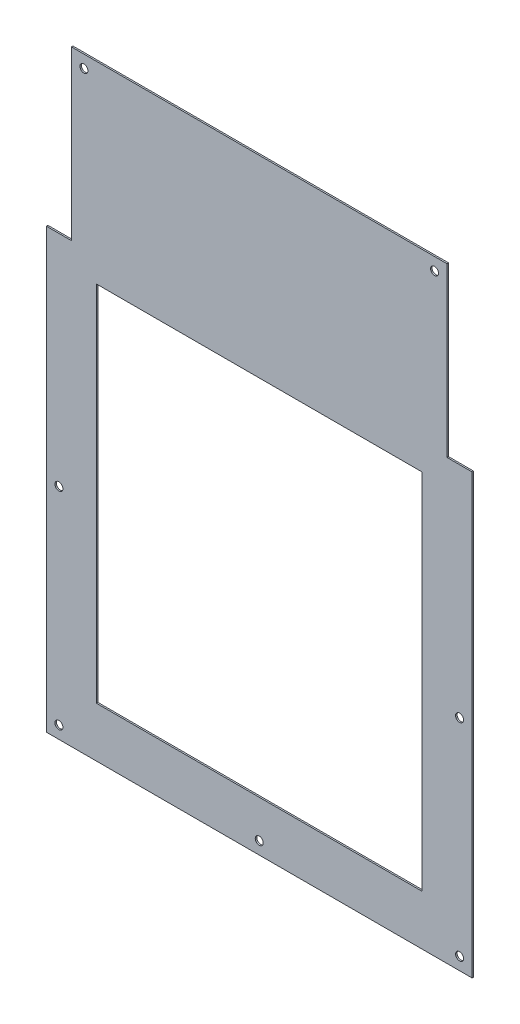
ISO-10303-21;
HEADER;
FILE_DESCRIPTION(('STEP AP214'),'2;1');
FILE_NAME('part.step','',(''),(''),'','','');
FILE_SCHEMA(('AUTOMOTIVE_DESIGN { 1 0 10303 214 1 1 1 1 }'));
ENDSEC;
DATA;
#1=APPLICATION_CONTEXT('core data for automotive mechanical design processes');
#2=APPLICATION_PROTOCOL_DEFINITION('international standard','automotive_design',2000,#1);
#3=PRODUCT_CONTEXT('',#1,'mechanical');
#4=PRODUCT('Part','Part','',(#3));
#5=PRODUCT_RELATED_PRODUCT_CATEGORY('part','',(#4));
#6=PRODUCT_DEFINITION_FORMATION('','',#4);
#7=PRODUCT_DEFINITION_CONTEXT('part definition',#1,'design');
#8=PRODUCT_DEFINITION('design','',#6,#7);
#9=PRODUCT_DEFINITION_SHAPE('','',#8);
#10=(LENGTH_UNIT() NAMED_UNIT(*) SI_UNIT(.MILLI.,.METRE.));
#11=(NAMED_UNIT(*) PLANE_ANGLE_UNIT() SI_UNIT($,.RADIAN.));
#12=(NAMED_UNIT(*) SI_UNIT($,.STERADIAN.) SOLID_ANGLE_UNIT());
#13=UNCERTAINTY_MEASURE_WITH_UNIT(LENGTH_MEASURE(1.E-05),#10,'distance_accuracy_value','');
#14=(GEOMETRIC_REPRESENTATION_CONTEXT(3) GLOBAL_UNCERTAINTY_ASSIGNED_CONTEXT((#13)) GLOBAL_UNIT_ASSIGNED_CONTEXT((#10,
#11,#12)) REPRESENTATION_CONTEXT('',''));
#15=CARTESIAN_POINT('',(0.,0.,0.));
#16=DIRECTION('',(0.,0.,1.));
#17=DIRECTION('',(1.,0.,0.));
#18=AXIS2_PLACEMENT_3D('',#15,#16,#17);
#19=CARTESIAN_POINT('',(0.,0.,0.6));
#20=DIRECTION('',(0.,0.,1.));
#21=DIRECTION('',(1.,0.,0.));
#22=AXIS2_PLACEMENT_3D('',#19,#20,#21);
#23=PLANE('',#22);
#24=CARTESIAN_POINT('',(85.,1079.,0.6));
#25=DIRECTION('',(0.,0.,1.));
#26=DIRECTION('',(1.,0.,0.));
#27=AXIS2_PLACEMENT_3D('',#24,#25,#26);
#28=CIRCLE('',#27,1.60000000000004);
#29=CARTESIAN_POINT('',(86.6000000000001,1079.,0.6));
#30=VERTEX_POINT('',#29);
#31=EDGE_CURVE('E328',#30,#30,#28,.T.);
#32=ORIENTED_EDGE('',*,*,#31,.F.);
#33=EDGE_LOOP('',(#32));
#34=FACE_BOUND('',#33,.T.);
#35=CARTESIAN_POINT('',(155.,847.,0.6));
#36=DIRECTION('',(0.,0.,1.));
#37=DIRECTION('',(1.,0.,0.));
#38=AXIS2_PLACEMENT_3D('',#35,#36,#37);
#39=CIRCLE('',#38,1.60000000000003);
#40=CARTESIAN_POINT('',(156.6,847.,0.6));
#41=VERTEX_POINT('',#40);
#42=EDGE_CURVE('E333',#41,#41,#39,.T.);
#43=ORIENTED_EDGE('',*,*,#42,.F.);
#44=EDGE_LOOP('',(#43));
#45=FACE_BOUND('',#44,.T.);
#46=CARTESIAN_POINT('',(225.,1079.,0.6));
#47=DIRECTION('',(0.,0.,1.));
#48=DIRECTION('',(-1.,0.,0.));
#49=AXIS2_PLACEMENT_3D('',#46,#47,#48);
#50=CIRCLE('',#49,1.60000000000003);
#51=CARTESIAN_POINT('',(223.4,1079.,0.6));
#52=VERTEX_POINT('',#51);
#53=EDGE_CURVE('E341',#52,#52,#50,.T.);
#54=ORIENTED_EDGE('',*,*,#53,.F.);
#55=EDGE_LOOP('',(#54));
#56=FACE_BOUND('',#55,.T.);
#57=CARTESIAN_POINT('',(74.9999999999998,929.5,0.6));
#58=DIRECTION('',(0.,0.,1.));
#59=DIRECTION('',(1.,0.,0.));
#60=AXIS2_PLACEMENT_3D('',#57,#58,#59);
#61=CIRCLE('',#60,1.60000000000003);
#62=CARTESIAN_POINT('',(76.5999999999998,929.5,0.6));
#63=VERTEX_POINT('',#62);
#64=EDGE_CURVE('E347',#63,#63,#61,.T.);
#65=ORIENTED_EDGE('',*,*,#64,.F.);
#66=EDGE_LOOP('',(#65));
#67=FACE_BOUND('',#66,.T.);
#68=CARTESIAN_POINT('',(235.,929.5,0.6));
#69=DIRECTION('',(0.,0.,1.));
#70=DIRECTION('',(-1.,0.,0.));
#71=AXIS2_PLACEMENT_3D('',#68,#69,#70);
#72=CIRCLE('',#71,1.60000000000003);
#73=CARTESIAN_POINT('',(233.4,929.5,0.6));
#74=VERTEX_POINT('',#73);
#75=EDGE_CURVE('E353',#74,#74,#72,.T.);
#76=ORIENTED_EDGE('',*,*,#75,.F.);
#77=EDGE_LOOP('',(#76));
#78=FACE_BOUND('',#77,.T.);
#79=CARTESIAN_POINT('',(74.9999999999998,847.,0.6));
#80=DIRECTION('',(0.,0.,1.));
#81=DIRECTION('',(1.,0.,0.));
#82=AXIS2_PLACEMENT_3D('',#79,#80,#81);
#83=CIRCLE('',#82,1.60000000000003);
#84=CARTESIAN_POINT('',(76.5999999999998,847.,0.6));
#85=VERTEX_POINT('',#84);
#86=EDGE_CURVE('E359',#85,#85,#83,.T.);
#87=ORIENTED_EDGE('',*,*,#86,.F.);
#88=EDGE_LOOP('',(#87));
#89=FACE_BOUND('',#88,.T.);
#90=CARTESIAN_POINT('',(235.,847.,0.6));
#91=DIRECTION('',(0.,0.,1.));
#92=DIRECTION('',(-1.,0.,0.));
#93=AXIS2_PLACEMENT_3D('',#90,#91,#92);
#94=CIRCLE('',#93,1.60000000000003);
#95=CARTESIAN_POINT('',(233.4,847.,0.6));
#96=VERTEX_POINT('',#95);
#97=EDGE_CURVE('E364',#96,#96,#94,.T.);
#98=ORIENTED_EDGE('',*,*,#97,.F.);
#99=EDGE_LOOP('',(#98));
#100=FACE_BOUND('',#99,.T.);
#101=DIRECTION('',(-1.,0.,0.));
#102=VECTOR('',#101,1.);
#103=CARTESIAN_POINT('',(230.,1084.,0.6));
#104=LINE('',#103,#102);
#105=CARTESIAN_POINT('',(230.,1084.,0.6));
#106=VERTEX_POINT('',#105);
#107=CARTESIAN_POINT('',(80.,1084.,0.6));
#108=VERTEX_POINT('',#107);
#109=EDGE_CURVE('E165',#106,#108,#104,.T.);
#110=ORIENTED_EDGE('',*,*,#109,.T.);
#111=DIRECTION('',(0.,-1.,0.));
#112=VECTOR('',#111,1.);
#113=CARTESIAN_POINT('',(80.,1084.,0.6));
#114=LINE('',#113,#112);
#115=CARTESIAN_POINT('',(80.,1017.,0.6));
#116=VERTEX_POINT('',#115);
#117=EDGE_CURVE('E168',#108,#116,#114,.T.);
#118=ORIENTED_EDGE('',*,*,#117,.T.);
#119=DIRECTION('',(-1.,0.,0.));
#120=VECTOR('',#119,1.);
#121=CARTESIAN_POINT('',(80.,1017.,0.6));
#122=LINE('',#121,#120);
#123=CARTESIAN_POINT('',(69.9999999999998,1017.,0.6));
#124=VERTEX_POINT('',#123);
#125=EDGE_CURVE('E171',#116,#124,#122,.T.);
#126=ORIENTED_EDGE('',*,*,#125,.T.);
#127=DIRECTION('',(0.,-1.,0.));
#128=VECTOR('',#127,1.);
#129=CARTESIAN_POINT('',(69.9999999999998,1017.,0.6));
#130=LINE('',#129,#128);
#131=CARTESIAN_POINT('',(69.9999999999998,842.,0.6));
#132=VERTEX_POINT('',#131);
#133=EDGE_CURVE('E173',#124,#132,#130,.T.);
#134=ORIENTED_EDGE('',*,*,#133,.T.);
#135=DIRECTION('',(1.,0.,0.));
#136=VECTOR('',#135,1.);
#137=CARTESIAN_POINT('',(69.9999999999998,842.,0.6));
#138=LINE('',#137,#136);
#139=CARTESIAN_POINT('',(240.,842.,0.6));
#140=VERTEX_POINT('',#139);
#141=EDGE_CURVE('E175',#132,#140,#138,.T.);
#142=ORIENTED_EDGE('',*,*,#141,.T.);
#143=DIRECTION('',(0.,1.,0.));
#144=VECTOR('',#143,1.);
#145=CARTESIAN_POINT('',(240.,842.,0.6));
#146=LINE('',#145,#144);
#147=CARTESIAN_POINT('',(240.,1017.,0.6));
#148=VERTEX_POINT('',#147);
#149=EDGE_CURVE('E177',#140,#148,#146,.T.);
#150=ORIENTED_EDGE('',*,*,#149,.T.);
#151=DIRECTION('',(-1.,0.,0.));
#152=VECTOR('',#151,1.);
#153=CARTESIAN_POINT('',(240.,1017.,0.6));
#154=LINE('',#153,#152);
#155=CARTESIAN_POINT('',(230.,1017.,0.6));
#156=VERTEX_POINT('',#155);
#157=EDGE_CURVE('E179',#148,#156,#154,.T.);
#158=ORIENTED_EDGE('',*,*,#157,.T.);
#159=DIRECTION('',(0.,1.,0.));
#160=VECTOR('',#159,1.);
#161=CARTESIAN_POINT('',(230.,1017.,0.6));
#162=LINE('',#161,#160);
#163=EDGE_CURVE('E181',#156,#106,#162,.T.);
#164=ORIENTED_EDGE('',*,*,#163,.T.);
#165=EDGE_LOOP('',(#110,#118,#126,#134,#142,#150,#158,#164));
#166=FACE_BOUND('',#165,.T.);
#167=DIRECTION('',(1.,0.,0.));
#168=VECTOR('',#167,1.);
#169=CARTESIAN_POINT('',(89.9999999999998,862.,0.6));
#170=LINE('',#169,#168);
#171=CARTESIAN_POINT('',(89.9999999999998,862.,0.6));
#172=VERTEX_POINT('',#171);
#173=CARTESIAN_POINT('',(220.,862.,0.6));
#174=VERTEX_POINT('',#173);
#175=EDGE_CURVE('E132',#172,#174,#170,.T.);
#176=ORIENTED_EDGE('',*,*,#175,.F.);
#177=DIRECTION('',(0.,-1.,0.));
#178=VECTOR('',#177,1.);
#179=CARTESIAN_POINT('',(89.9999999999998,996.999999999999,0.6));
#180=LINE('',#179,#178);
#181=CARTESIAN_POINT('',(90.,1007.,0.6));
#182=VERTEX_POINT('',#181);
#183=EDGE_CURVE('E124',#182,#172,#180,.T.);
#184=ORIENTED_EDGE('',*,*,#183,.F.);
#185=DIRECTION('',(-1.,0.,0.));
#186=VECTOR('',#185,1.);
#187=CARTESIAN_POINT('',(90.,1007.,0.6));
#188=LINE('',#187,#186);
#189=CARTESIAN_POINT('',(220.,1007.,0.6));
#190=VERTEX_POINT('',#189);
#191=EDGE_CURVE('E148',#190,#182,#188,.T.);
#192=ORIENTED_EDGE('',*,*,#191,.F.);
#193=DIRECTION('',(0.,1.,0.));
#194=VECTOR('',#193,1.);
#195=CARTESIAN_POINT('',(220.,862.,0.6));
#196=LINE('',#195,#194);
#197=EDGE_CURVE('E146',#174,#190,#196,.T.);
#198=ORIENTED_EDGE('',*,*,#197,.F.);
#199=EDGE_LOOP('',(#176,#184,#192,#198));
#200=FACE_BOUND('',#199,.T.);
#201=ADVANCED_FACE('F37',(#34,#45,#56,#67,#78,#89,#100,#166,#200),#23,.T.);
#202=CARTESIAN_POINT('',(0.,0.,0.));
#203=DIRECTION('',(0.,0.,1.));
#204=DIRECTION('',(1.,0.,0.));
#205=AXIS2_PLACEMENT_3D('',#202,#203,#204);
#206=PLANE('',#205);
#207=CARTESIAN_POINT('',(85.,1079.,0.));
#208=DIRECTION('',(0.,0.,1.));
#209=DIRECTION('',(1.,0.,0.));
#210=AXIS2_PLACEMENT_3D('',#207,#208,#209);
#211=CIRCLE('',#210,1.60000000000004);
#212=CARTESIAN_POINT('',(86.6000000000001,1079.,0.));
#213=VERTEX_POINT('',#212);
#214=EDGE_CURVE('E155',#213,#213,#211,.T.);
#215=ORIENTED_EDGE('',*,*,#214,.T.);
#216=EDGE_LOOP('',(#215));
#217=FACE_BOUND('',#216,.T.);
#218=CARTESIAN_POINT('',(155.,847.,0.));
#219=DIRECTION('',(0.,0.,1.));
#220=DIRECTION('',(1.,0.,0.));
#221=AXIS2_PLACEMENT_3D('',#218,#219,#220);
#222=CIRCLE('',#221,1.60000000000003);
#223=CARTESIAN_POINT('',(156.6,847.,0.));
#224=VERTEX_POINT('',#223);
#225=EDGE_CURVE('E329',#224,#224,#222,.T.);
#226=ORIENTED_EDGE('',*,*,#225,.T.);
#227=EDGE_LOOP('',(#226));
#228=FACE_BOUND('',#227,.T.);
#229=CARTESIAN_POINT('',(225.,1079.,0.));
#230=DIRECTION('',(0.,0.,1.));
#231=DIRECTION('',(-1.,0.,0.));
#232=AXIS2_PLACEMENT_3D('',#229,#230,#231);
#233=CIRCLE('',#232,1.60000000000003);
#234=CARTESIAN_POINT('',(223.4,1079.,0.));
#235=VERTEX_POINT('',#234);
#236=EDGE_CURVE('E338',#235,#235,#233,.T.);
#237=ORIENTED_EDGE('',*,*,#236,.T.);
#238=EDGE_LOOP('',(#237));
#239=FACE_BOUND('',#238,.T.);
#240=CARTESIAN_POINT('',(74.9999999999998,929.5,0.));
#241=DIRECTION('',(0.,0.,1.));
#242=DIRECTION('',(1.,0.,0.));
#243=AXIS2_PLACEMENT_3D('',#240,#241,#242);
#244=CIRCLE('',#243,1.60000000000003);
#245=CARTESIAN_POINT('',(76.5999999999998,929.5,0.));
#246=VERTEX_POINT('',#245);
#247=EDGE_CURVE('E344',#246,#246,#244,.T.);
#248=ORIENTED_EDGE('',*,*,#247,.T.);
#249=EDGE_LOOP('',(#248));
#250=FACE_BOUND('',#249,.T.);
#251=CARTESIAN_POINT('',(235.,929.5,0.));
#252=DIRECTION('',(0.,0.,1.));
#253=DIRECTION('',(-1.,0.,0.));
#254=AXIS2_PLACEMENT_3D('',#251,#252,#253);
#255=CIRCLE('',#254,1.60000000000003);
#256=CARTESIAN_POINT('',(233.4,929.5,0.));
#257=VERTEX_POINT('',#256);
#258=EDGE_CURVE('E350',#257,#257,#255,.T.);
#259=ORIENTED_EDGE('',*,*,#258,.T.);
#260=EDGE_LOOP('',(#259));
#261=FACE_BOUND('',#260,.T.);
#262=CARTESIAN_POINT('',(74.9999999999998,847.,0.));
#263=DIRECTION('',(0.,0.,1.));
#264=DIRECTION('',(1.,0.,0.));
#265=AXIS2_PLACEMENT_3D('',#262,#263,#264);
#266=CIRCLE('',#265,1.60000000000003);
#267=CARTESIAN_POINT('',(76.5999999999998,847.,0.));
#268=VERTEX_POINT('',#267);
#269=EDGE_CURVE('E356',#268,#268,#266,.T.);
#270=ORIENTED_EDGE('',*,*,#269,.T.);
#271=EDGE_LOOP('',(#270));
#272=FACE_BOUND('',#271,.T.);
#273=CARTESIAN_POINT('',(235.,847.,0.));
#274=DIRECTION('',(0.,0.,1.));
#275=DIRECTION('',(-1.,0.,0.));
#276=AXIS2_PLACEMENT_3D('',#273,#274,#275);
#277=CIRCLE('',#276,1.60000000000003);
#278=CARTESIAN_POINT('',(233.4,847.,0.));
#279=VERTEX_POINT('',#278);
#280=EDGE_CURVE('E362',#279,#279,#277,.T.);
#281=ORIENTED_EDGE('',*,*,#280,.T.);
#282=EDGE_LOOP('',(#281));
#283=FACE_BOUND('',#282,.T.);
#284=DIRECTION('',(-1.,0.,0.));
#285=VECTOR('',#284,1.);
#286=CARTESIAN_POINT('',(230.,1084.,0.));
#287=LINE('',#286,#285);
#288=CARTESIAN_POINT('',(230.,1084.,0.));
#289=VERTEX_POINT('',#288);
#290=CARTESIAN_POINT('',(80.,1084.,0.));
#291=VERTEX_POINT('',#290);
#292=EDGE_CURVE('E142',#289,#291,#287,.T.);
#293=ORIENTED_EDGE('',*,*,#292,.F.);
#294=DIRECTION('',(0.,1.,0.));
#295=VECTOR('',#294,1.);
#296=CARTESIAN_POINT('',(230.,1017.,0.));
#297=LINE('',#296,#295);
#298=CARTESIAN_POINT('',(230.,1017.,0.));
#299=VERTEX_POINT('',#298);
#300=EDGE_CURVE('E169',#299,#289,#297,.T.);
#301=ORIENTED_EDGE('',*,*,#300,.F.);
#302=DIRECTION('',(-1.,0.,0.));
#303=VECTOR('',#302,1.);
#304=CARTESIAN_POINT('',(240.,1017.,0.));
#305=LINE('',#304,#303);
#306=CARTESIAN_POINT('',(240.,1017.,0.));
#307=VERTEX_POINT('',#306);
#308=EDGE_CURVE('E196',#307,#299,#305,.T.);
#309=ORIENTED_EDGE('',*,*,#308,.F.);
#310=DIRECTION('',(0.,1.,0.));
#311=VECTOR('',#310,1.);
#312=CARTESIAN_POINT('',(240.,842.,0.));
#313=LINE('',#312,#311);
#314=CARTESIAN_POINT('',(240.,842.,0.));
#315=VERTEX_POINT('',#314);
#316=EDGE_CURVE('E194',#315,#307,#313,.T.);
#317=ORIENTED_EDGE('',*,*,#316,.F.);
#318=DIRECTION('',(1.,0.,0.));
#319=VECTOR('',#318,1.);
#320=CARTESIAN_POINT('',(69.9999999999998,842.,0.));
#321=LINE('',#320,#319);
#322=CARTESIAN_POINT('',(69.9999999999998,842.,0.));
#323=VERTEX_POINT('',#322);
#324=EDGE_CURVE('E192',#323,#315,#321,.T.);
#325=ORIENTED_EDGE('',*,*,#324,.F.);
#326=DIRECTION('',(0.,-1.,0.));
#327=VECTOR('',#326,1.);
#328=CARTESIAN_POINT('',(69.9999999999998,1017.,0.));
#329=LINE('',#328,#327);
#330=CARTESIAN_POINT('',(69.9999999999998,1017.,0.));
#331=VERTEX_POINT('',#330);
#332=EDGE_CURVE('E190',#331,#323,#329,.T.);
#333=ORIENTED_EDGE('',*,*,#332,.F.);
#334=DIRECTION('',(-1.,0.,0.));
#335=VECTOR('',#334,1.);
#336=CARTESIAN_POINT('',(80.,1017.,0.));
#337=LINE('',#336,#335);
#338=CARTESIAN_POINT('',(80.,1017.,0.));
#339=VERTEX_POINT('',#338);
#340=EDGE_CURVE('E188',#339,#331,#337,.T.);
#341=ORIENTED_EDGE('',*,*,#340,.F.);
#342=DIRECTION('',(0.,-1.,0.));
#343=VECTOR('',#342,1.);
#344=CARTESIAN_POINT('',(80.,1084.,0.));
#345=LINE('',#344,#343);
#346=EDGE_CURVE('E186',#291,#339,#345,.T.);
#347=ORIENTED_EDGE('',*,*,#346,.F.);
#348=EDGE_LOOP('',(#293,#301,#309,#317,#325,#333,#341,#347));
#349=FACE_BOUND('',#348,.T.);
#350=DIRECTION('',(0.,-1.,0.));
#351=VECTOR('',#350,1.);
#352=CARTESIAN_POINT('',(89.9999999999998,996.999999999999,0.));
#353=LINE('',#352,#351);
#354=CARTESIAN_POINT('',(90.,1007.,0.));
#355=VERTEX_POINT('',#354);
#356=CARTESIAN_POINT('',(89.9999999999998,862.,0.));
#357=VERTEX_POINT('',#356);
#358=EDGE_CURVE('E153',#355,#357,#353,.T.);
#359=ORIENTED_EDGE('',*,*,#358,.T.);
#360=DIRECTION('',(1.,0.,0.));
#361=VECTOR('',#360,1.);
#362=CARTESIAN_POINT('',(89.9999999999998,862.,0.));
#363=LINE('',#362,#361);
#364=CARTESIAN_POINT('',(220.,862.,0.));
#365=VERTEX_POINT('',#364);
#366=EDGE_CURVE('E140',#357,#365,#363,.T.);
#367=ORIENTED_EDGE('',*,*,#366,.T.);
#368=DIRECTION('',(0.,1.,0.));
#369=VECTOR('',#368,1.);
#370=CARTESIAN_POINT('',(220.,997.,0.));
#371=LINE('',#370,#369);
#372=CARTESIAN_POINT('',(220.,1007.,0.));
#373=VERTEX_POINT('',#372);
#374=EDGE_CURVE('E157',#365,#373,#371,.T.);
#375=ORIENTED_EDGE('',*,*,#374,.T.);
#376=DIRECTION('',(-1.,0.,0.));
#377=VECTOR('',#376,1.);
#378=CARTESIAN_POINT('',(90.,1007.,0.));
#379=LINE('',#378,#377);
#380=EDGE_CURVE('E133',#373,#355,#379,.T.);
#381=ORIENTED_EDGE('',*,*,#380,.T.);
#382=EDGE_LOOP('',(#359,#367,#375,#381));
#383=FACE_BOUND('',#382,.T.);
#384=ADVANCED_FACE('F226',(#217,#228,#239,#250,#261,#272,#283,#349,#383),#206,.F.);
#385=CARTESIAN_POINT('',(230.,1084.,0.6));
#386=DIRECTION('',(0.,-1.,0.));
#387=DIRECTION('',(0.,0.,-1.));
#388=AXIS2_PLACEMENT_3D('',#385,#386,#387);
#389=PLANE('',#388);
#390=ORIENTED_EDGE('',*,*,#292,.T.);
#391=DIRECTION('',(0.,0.,-1.));
#392=VECTOR('',#391,1.);
#393=CARTESIAN_POINT('',(80.,1084.,0.6));
#394=LINE('',#393,#392);
#395=EDGE_CURVE('E11',#108,#291,#394,.T.);
#396=ORIENTED_EDGE('',*,*,#395,.F.);
#397=ORIENTED_EDGE('',*,*,#109,.F.);
#398=DIRECTION('',(0.,0.,-1.));
#399=VECTOR('',#398,1.);
#400=CARTESIAN_POINT('',(230.,1084.,0.6));
#401=LINE('',#400,#399);
#402=EDGE_CURVE('E183',#106,#289,#401,.T.);
#403=ORIENTED_EDGE('',*,*,#402,.T.);
#404=EDGE_LOOP('',(#390,#396,#397,#403));
#405=FACE_BOUND('',#404,.T.);
#406=ADVANCED_FACE('F39',(#405),#389,.F.);
#407=CARTESIAN_POINT('',(80.,1084.,0.6));
#408=DIRECTION('',(1.,0.,0.));
#409=DIRECTION('',(0.,0.,-1.));
#410=AXIS2_PLACEMENT_3D('',#407,#408,#409);
#411=PLANE('',#410);
#412=ORIENTED_EDGE('',*,*,#346,.T.);
#413=DIRECTION('',(0.,0.,-1.));
#414=VECTOR('',#413,1.);
#415=CARTESIAN_POINT('',(80.,1017.,0.6));
#416=LINE('',#415,#414);
#417=EDGE_CURVE('E45',#116,#339,#416,.T.);
#418=ORIENTED_EDGE('',*,*,#417,.F.);
#419=ORIENTED_EDGE('',*,*,#117,.F.);
#420=ORIENTED_EDGE('',*,*,#395,.T.);
#421=EDGE_LOOP('',(#412,#418,#419,#420));
#422=FACE_BOUND('',#421,.T.);
#423=ADVANCED_FACE('F243',(#422),#411,.F.);
#424=CARTESIAN_POINT('',(80.,1017.,0.6));
#425=DIRECTION('',(0.,-1.,0.));
#426=DIRECTION('',(0.,0.,-1.));
#427=AXIS2_PLACEMENT_3D('',#424,#425,#426);
#428=PLANE('',#427);
#429=ORIENTED_EDGE('',*,*,#340,.T.);
#430=DIRECTION('',(0.,0.,-1.));
#431=VECTOR('',#430,1.);
#432=CARTESIAN_POINT('',(69.9999999999998,1017.,0.6));
#433=LINE('',#432,#431);
#434=EDGE_CURVE('E213',#124,#331,#433,.T.);
#435=ORIENTED_EDGE('',*,*,#434,.F.);
#436=ORIENTED_EDGE('',*,*,#125,.F.);
#437=ORIENTED_EDGE('',*,*,#417,.T.);
#438=EDGE_LOOP('',(#429,#435,#436,#437));
#439=FACE_BOUND('',#438,.T.);
#440=ADVANCED_FACE('F220',(#439),#428,.F.);
#441=CARTESIAN_POINT('',(69.9999999999998,1017.,0.6));
#442=DIRECTION('',(1.,0.,0.));
#443=DIRECTION('',(0.,0.,-1.));
#444=AXIS2_PLACEMENT_3D('',#441,#442,#443);
#445=PLANE('',#444);
#446=ORIENTED_EDGE('',*,*,#332,.T.);
#447=DIRECTION('',(0.,0.,-1.));
#448=VECTOR('',#447,1.);
#449=CARTESIAN_POINT('',(69.9999999999998,842.,0.6));
#450=LINE('',#449,#448);
#451=EDGE_CURVE('E210',#132,#323,#450,.T.);
#452=ORIENTED_EDGE('',*,*,#451,.F.);
#453=ORIENTED_EDGE('',*,*,#133,.F.);
#454=ORIENTED_EDGE('',*,*,#434,.T.);
#455=EDGE_LOOP('',(#446,#452,#453,#454));
#456=FACE_BOUND('',#455,.T.);
#457=ADVANCED_FACE('F232',(#456),#445,.F.);
#458=CARTESIAN_POINT('',(69.9999999999998,842.,0.6));
#459=DIRECTION('',(0.,1.,0.));
#460=DIRECTION('',(0.,0.,1.));
#461=AXIS2_PLACEMENT_3D('',#458,#459,#460);
#462=PLANE('',#461);
#463=ORIENTED_EDGE('',*,*,#324,.T.);
#464=DIRECTION('',(0.,0.,-1.));
#465=VECTOR('',#464,1.);
#466=CARTESIAN_POINT('',(240.,842.,0.6));
#467=LINE('',#466,#465);
#468=EDGE_CURVE('E207',#140,#315,#467,.T.);
#469=ORIENTED_EDGE('',*,*,#468,.F.);
#470=ORIENTED_EDGE('',*,*,#141,.F.);
#471=ORIENTED_EDGE('',*,*,#451,.T.);
#472=EDGE_LOOP('',(#463,#469,#470,#471));
#473=FACE_BOUND('',#472,.T.);
#474=ADVANCED_FACE('F236',(#473),#462,.F.);
#475=CARTESIAN_POINT('',(240.,842.,0.6));
#476=DIRECTION('',(-1.,0.,0.));
#477=DIRECTION('',(0.,0.,1.));
#478=AXIS2_PLACEMENT_3D('',#475,#476,#477);
#479=PLANE('',#478);
#480=ORIENTED_EDGE('',*,*,#316,.T.);
#481=DIRECTION('',(0.,0.,-1.));
#482=VECTOR('',#481,1.);
#483=CARTESIAN_POINT('',(240.,1017.,0.6));
#484=LINE('',#483,#482);
#485=EDGE_CURVE('E204',#148,#307,#484,.T.);
#486=ORIENTED_EDGE('',*,*,#485,.F.);
#487=ORIENTED_EDGE('',*,*,#149,.F.);
#488=ORIENTED_EDGE('',*,*,#468,.T.);
#489=EDGE_LOOP('',(#480,#486,#487,#488));
#490=FACE_BOUND('',#489,.T.);
#491=ADVANCED_FACE('F256',(#490),#479,.F.);
#492=CARTESIAN_POINT('',(240.,1017.,0.6));
#493=DIRECTION('',(0.,-1.,0.));
#494=DIRECTION('',(0.,0.,-1.));
#495=AXIS2_PLACEMENT_3D('',#492,#493,#494);
#496=PLANE('',#495);
#497=ORIENTED_EDGE('',*,*,#308,.T.);
#498=DIRECTION('',(0.,0.,-1.));
#499=VECTOR('',#498,1.);
#500=CARTESIAN_POINT('',(230.,1017.,0.6));
#501=LINE('',#500,#499);
#502=EDGE_CURVE('E201',#156,#299,#501,.T.);
#503=ORIENTED_EDGE('',*,*,#502,.F.);
#504=ORIENTED_EDGE('',*,*,#157,.F.);
#505=ORIENTED_EDGE('',*,*,#485,.T.);
#506=EDGE_LOOP('',(#497,#503,#504,#505));
#507=FACE_BOUND('',#506,.T.);
#508=ADVANCED_FACE('F254',(#507),#496,.F.);
#509=CARTESIAN_POINT('',(230.,1017.,0.6));
#510=DIRECTION('',(-1.,0.,0.));
#511=DIRECTION('',(0.,0.,1.));
#512=AXIS2_PLACEMENT_3D('',#509,#510,#511);
#513=PLANE('',#512);
#514=ORIENTED_EDGE('',*,*,#300,.T.);
#515=ORIENTED_EDGE('',*,*,#402,.F.);
#516=ORIENTED_EDGE('',*,*,#163,.F.);
#517=ORIENTED_EDGE('',*,*,#502,.T.);
#518=EDGE_LOOP('',(#514,#515,#516,#517));
#519=FACE_BOUND('',#518,.T.);
#520=ADVANCED_FACE('F249',(#519),#513,.F.);
#521=CARTESIAN_POINT('',(89.9999999999998,996.999999999999,0.6));
#522=DIRECTION('',(1.,0.,0.));
#523=DIRECTION('',(0.,0.,-1.));
#524=AXIS2_PLACEMENT_3D('',#521,#522,#523);
#525=PLANE('',#524);
#526=ORIENTED_EDGE('',*,*,#358,.F.);
#527=DIRECTION('',(0.,0.,-1.));
#528=VECTOR('',#527,1.);
#529=CARTESIAN_POINT('',(90.,1007.,0.6));
#530=LINE('',#529,#528);
#531=EDGE_CURVE('E57',#182,#355,#530,.T.);
#532=ORIENTED_EDGE('',*,*,#531,.F.);
#533=ORIENTED_EDGE('',*,*,#183,.T.);
#534=DIRECTION('',(0.,0.,-1.));
#535=VECTOR('',#534,1.);
#536=CARTESIAN_POINT('',(89.9999999999998,862.,0.6));
#537=LINE('',#536,#535);
#538=EDGE_CURVE('E127',#172,#357,#537,.T.);
#539=ORIENTED_EDGE('',*,*,#538,.T.);
#540=EDGE_LOOP('',(#526,#532,#533,#539));
#541=FACE_BOUND('',#540,.T.);
#542=ADVANCED_FACE('F126',(#541),#525,.T.);
#543=CARTESIAN_POINT('',(89.9999999999998,862.,0.6));
#544=DIRECTION('',(0.,1.,0.));
#545=DIRECTION('',(0.,0.,1.));
#546=AXIS2_PLACEMENT_3D('',#543,#544,#545);
#547=PLANE('',#546);
#548=ORIENTED_EDGE('',*,*,#366,.F.);
#549=ORIENTED_EDGE('',*,*,#538,.F.);
#550=ORIENTED_EDGE('',*,*,#175,.T.);
#551=DIRECTION('',(0.,0.,-1.));
#552=VECTOR('',#551,1.);
#553=CARTESIAN_POINT('',(220.,862.,0.6));
#554=LINE('',#553,#552);
#555=EDGE_CURVE('E143',#174,#365,#554,.T.);
#556=ORIENTED_EDGE('',*,*,#555,.T.);
#557=EDGE_LOOP('',(#548,#549,#550,#556));
#558=FACE_BOUND('',#557,.T.);
#559=ADVANCED_FACE('F136',(#558),#547,.T.);
#560=CARTESIAN_POINT('',(220.,997.,0.6));
#561=DIRECTION('',(-1.,0.,0.));
#562=DIRECTION('',(0.,-1.,0.));
#563=AXIS2_PLACEMENT_3D('',#560,#561,#562);
#564=PLANE('',#563);
#565=ORIENTED_EDGE('',*,*,#374,.F.);
#566=ORIENTED_EDGE('',*,*,#555,.F.);
#567=ORIENTED_EDGE('',*,*,#197,.T.);
#568=DIRECTION('',(0.,0.,-1.));
#569=VECTOR('',#568,1.);
#570=CARTESIAN_POINT('',(220.,1007.,0.6));
#571=LINE('',#570,#569);
#572=EDGE_CURVE('E52',#190,#373,#571,.T.);
#573=ORIENTED_EDGE('',*,*,#572,.T.);
#574=EDGE_LOOP('',(#565,#566,#567,#573));
#575=FACE_BOUND('',#574,.T.);
#576=ADVANCED_FACE('F285',(#575),#564,.T.);
#577=CARTESIAN_POINT('',(90.,1007.,0.6));
#578=DIRECTION('',(0.,-1.,0.));
#579=DIRECTION('',(1.,0.,0.));
#580=AXIS2_PLACEMENT_3D('',#577,#578,#579);
#581=PLANE('',#580);
#582=ORIENTED_EDGE('',*,*,#380,.F.);
#583=ORIENTED_EDGE('',*,*,#572,.F.);
#584=ORIENTED_EDGE('',*,*,#191,.T.);
#585=ORIENTED_EDGE('',*,*,#531,.T.);
#586=EDGE_LOOP('',(#582,#583,#584,#585));
#587=FACE_BOUND('',#586,.T.);
#588=ADVANCED_FACE('F289',(#587),#581,.T.);
#589=CARTESIAN_POINT('',(235.,847.,0.));
#590=DIRECTION('',(0.,0.,1.));
#591=DIRECTION('',(1.,0.,0.));
#592=AXIS2_PLACEMENT_3D('',#589,#590,#591);
#593=CYLINDRICAL_SURFACE('',#592,1.60000000000003);
#594=ORIENTED_EDGE('',*,*,#280,.F.);
#595=EDGE_LOOP('',(#594));
#596=FACE_BOUND('',#595,.T.);
#597=ORIENTED_EDGE('',*,*,#97,.T.);
#598=EDGE_LOOP('',(#597));
#599=FACE_BOUND('',#598,.T.);
#600=ADVANCED_FACE('F295',(#596,#599),#593,.F.);
#601=CARTESIAN_POINT('',(74.9999999999998,847.,0.));
#602=DIRECTION('',(0.,0.,1.));
#603=DIRECTION('',(1.,0.,0.));
#604=AXIS2_PLACEMENT_3D('',#601,#602,#603);
#605=CYLINDRICAL_SURFACE('',#604,1.60000000000003);
#606=ORIENTED_EDGE('',*,*,#269,.F.);
#607=EDGE_LOOP('',(#606));
#608=FACE_BOUND('',#607,.T.);
#609=ORIENTED_EDGE('',*,*,#86,.T.);
#610=EDGE_LOOP('',(#609));
#611=FACE_BOUND('',#610,.T.);
#612=ADVANCED_FACE('F298',(#608,#611),#605,.F.);
#613=CARTESIAN_POINT('',(235.,929.5,0.));
#614=DIRECTION('',(0.,0.,1.));
#615=DIRECTION('',(1.,0.,0.));
#616=AXIS2_PLACEMENT_3D('',#613,#614,#615);
#617=CYLINDRICAL_SURFACE('',#616,1.60000000000003);
#618=ORIENTED_EDGE('',*,*,#258,.F.);
#619=EDGE_LOOP('',(#618));
#620=FACE_BOUND('',#619,.T.);
#621=ORIENTED_EDGE('',*,*,#75,.T.);
#622=EDGE_LOOP('',(#621));
#623=FACE_BOUND('',#622,.T.);
#624=ADVANCED_FACE('F302',(#620,#623),#617,.F.);
#625=CARTESIAN_POINT('',(74.9999999999998,929.5,0.));
#626=DIRECTION('',(0.,0.,1.));
#627=DIRECTION('',(1.,0.,0.));
#628=AXIS2_PLACEMENT_3D('',#625,#626,#627);
#629=CYLINDRICAL_SURFACE('',#628,1.60000000000003);
#630=ORIENTED_EDGE('',*,*,#247,.F.);
#631=EDGE_LOOP('',(#630));
#632=FACE_BOUND('',#631,.T.);
#633=ORIENTED_EDGE('',*,*,#64,.T.);
#634=EDGE_LOOP('',(#633));
#635=FACE_BOUND('',#634,.T.);
#636=ADVANCED_FACE('F306',(#632,#635),#629,.F.);
#637=CARTESIAN_POINT('',(225.,1079.,0.));
#638=DIRECTION('',(0.,0.,1.));
#639=DIRECTION('',(1.,0.,0.));
#640=AXIS2_PLACEMENT_3D('',#637,#638,#639);
#641=CYLINDRICAL_SURFACE('',#640,1.60000000000003);
#642=ORIENTED_EDGE('',*,*,#236,.F.);
#643=EDGE_LOOP('',(#642));
#644=FACE_BOUND('',#643,.T.);
#645=ORIENTED_EDGE('',*,*,#53,.T.);
#646=EDGE_LOOP('',(#645));
#647=FACE_BOUND('',#646,.T.);
#648=ADVANCED_FACE('F310',(#644,#647),#641,.F.);
#649=CARTESIAN_POINT('',(155.,847.,0.));
#650=DIRECTION('',(0.,0.,1.));
#651=DIRECTION('',(1.,0.,0.));
#652=AXIS2_PLACEMENT_3D('',#649,#650,#651);
#653=CYLINDRICAL_SURFACE('',#652,1.60000000000003);
#654=ORIENTED_EDGE('',*,*,#225,.F.);
#655=EDGE_LOOP('',(#654));
#656=FACE_BOUND('',#655,.T.);
#657=ORIENTED_EDGE('',*,*,#42,.T.);
#658=EDGE_LOOP('',(#657));
#659=FACE_BOUND('',#658,.T.);
#660=ADVANCED_FACE('F314',(#656,#659),#653,.F.);
#661=CARTESIAN_POINT('',(85.,1079.,0.));
#662=DIRECTION('',(0.,0.,1.));
#663=DIRECTION('',(1.,0.,0.));
#664=AXIS2_PLACEMENT_3D('',#661,#662,#663);
#665=CYLINDRICAL_SURFACE('',#664,1.60000000000004);
#666=ORIENTED_EDGE('',*,*,#214,.F.);
#667=EDGE_LOOP('',(#666));
#668=FACE_BOUND('',#667,.T.);
#669=ORIENTED_EDGE('',*,*,#31,.T.);
#670=EDGE_LOOP('',(#669));
#671=FACE_BOUND('',#670,.T.);
#672=ADVANCED_FACE('F318',(#668,#671),#665,.F.);
#673=CLOSED_SHELL('',(#201,#384,#406,#423,#440,#457,#474,#491,#508,#520,#542,#559,#576,#588,
#600,#612,#624,#636,#648,#660,#672));
#674=MANIFOLD_SOLID_BREP('B2',#673);
#675=ADVANCED_BREP_SHAPE_REPRESENTATION('',(#18,#674),#14);
#676=SHAPE_DEFINITION_REPRESENTATION(#9,#675);
ENDSEC;
END-ISO-10303-21;
